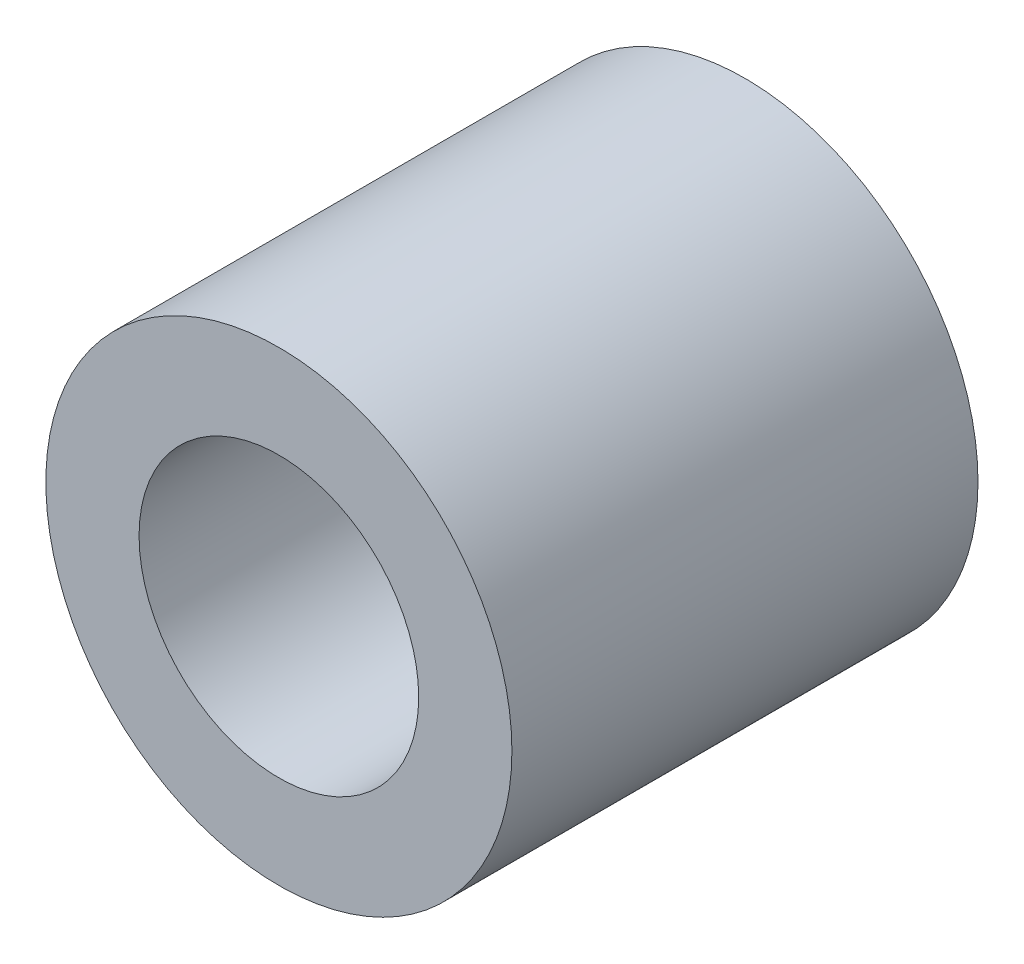
ISO-10303-21;
HEADER;
FILE_DESCRIPTION(('STEP AP214'),'2;1');
FILE_NAME('part.step','',(''),(''),'','','');
FILE_SCHEMA(('AUTOMOTIVE_DESIGN { 1 0 10303 214 1 1 1 1 }'));
ENDSEC;
DATA;
#1=APPLICATION_CONTEXT('core data for automotive mechanical design processes');
#2=APPLICATION_PROTOCOL_DEFINITION('international standard','automotive_design',2000,#1);
#3=PRODUCT_CONTEXT('',#1,'mechanical');
#4=PRODUCT('Part','Part','',(#3));
#5=PRODUCT_RELATED_PRODUCT_CATEGORY('part','',(#4));
#6=PRODUCT_DEFINITION_FORMATION('','',#4);
#7=PRODUCT_DEFINITION_CONTEXT('part definition',#1,'design');
#8=PRODUCT_DEFINITION('design','',#6,#7);
#9=PRODUCT_DEFINITION_SHAPE('','',#8);
#10=(LENGTH_UNIT() NAMED_UNIT(*) SI_UNIT(.MILLI.,.METRE.));
#11=(NAMED_UNIT(*) PLANE_ANGLE_UNIT() SI_UNIT($,.RADIAN.));
#12=(NAMED_UNIT(*) SI_UNIT($,.STERADIAN.) SOLID_ANGLE_UNIT());
#13=UNCERTAINTY_MEASURE_WITH_UNIT(LENGTH_MEASURE(1.E-05),#10,'distance_accuracy_value','');
#14=(GEOMETRIC_REPRESENTATION_CONTEXT(3) GLOBAL_UNCERTAINTY_ASSIGNED_CONTEXT((#13)) GLOBAL_UNIT_ASSIGNED_CONTEXT((#10,
#11,#12)) REPRESENTATION_CONTEXT('',''));
#15=CARTESIAN_POINT('',(0.,0.,0.));
#16=DIRECTION('',(0.,0.,1.));
#17=DIRECTION('',(1.,0.,0.));
#18=AXIS2_PLACEMENT_3D('',#15,#16,#17);
#19=CARTESIAN_POINT('',(0.,0.,5.));
#20=DIRECTION('',(0.,0.,1.));
#21=DIRECTION('',(1.,0.,0.));
#22=AXIS2_PLACEMENT_3D('',#19,#20,#21);
#23=PLANE('',#22);
#24=CARTESIAN_POINT('',(0.,0.,5.));
#25=DIRECTION('',(0.,0.,1.));
#26=DIRECTION('',(1.,0.,0.));
#27=AXIS2_PLACEMENT_3D('',#24,#25,#26);
#28=CIRCLE('',#27,2.5);
#29=CARTESIAN_POINT('',(2.5,0.,5.));
#30=VERTEX_POINT('',#29);
#31=EDGE_CURVE('E10',#30,#30,#28,.T.);
#32=ORIENTED_EDGE('',*,*,#31,.T.);
#33=EDGE_LOOP('',(#32));
#34=FACE_BOUND('',#33,.T.);
#35=CARTESIAN_POINT('',(0.,0.,5.));
#36=DIRECTION('',(0.,0.,1.));
#37=DIRECTION('',(1.,0.,0.));
#38=AXIS2_PLACEMENT_3D('',#35,#36,#37);
#39=CIRCLE('',#38,1.5);
#40=CARTESIAN_POINT('',(1.5,0.,5.));
#41=VERTEX_POINT('',#40);
#42=EDGE_CURVE('E44',#41,#41,#39,.T.);
#43=ORIENTED_EDGE('',*,*,#42,.F.);
#44=EDGE_LOOP('',(#43));
#45=FACE_BOUND('',#44,.T.);
#46=ADVANCED_FACE('F33',(#34,#45),#23,.T.);
#47=CARTESIAN_POINT('',(0.,0.,0.));
#48=DIRECTION('',(0.,0.,1.));
#49=DIRECTION('',(1.,0.,0.));
#50=AXIS2_PLACEMENT_3D('',#47,#48,#49);
#51=PLANE('',#50);
#52=CARTESIAN_POINT('',(0.,0.,0.));
#53=DIRECTION('',(0.,0.,1.));
#54=DIRECTION('',(1.,0.,0.));
#55=AXIS2_PLACEMENT_3D('',#52,#53,#54);
#56=CIRCLE('',#55,2.5);
#57=CARTESIAN_POINT('',(2.5,0.,0.));
#58=VERTEX_POINT('',#57);
#59=EDGE_CURVE('E37',#58,#58,#56,.T.);
#60=ORIENTED_EDGE('',*,*,#59,.F.);
#61=EDGE_LOOP('',(#60));
#62=FACE_BOUND('',#61,.T.);
#63=CARTESIAN_POINT('',(0.,0.,0.));
#64=DIRECTION('',(0.,0.,1.));
#65=DIRECTION('',(1.,0.,0.));
#66=AXIS2_PLACEMENT_3D('',#63,#64,#65);
#67=CIRCLE('',#66,1.5);
#68=CARTESIAN_POINT('',(1.5,0.,0.));
#69=VERTEX_POINT('',#68);
#70=EDGE_CURVE('E46',#69,#69,#67,.T.);
#71=ORIENTED_EDGE('',*,*,#70,.T.);
#72=EDGE_LOOP('',(#71));
#73=FACE_BOUND('',#72,.T.);
#74=ADVANCED_FACE('F56',(#62,#73),#51,.F.);
#75=CARTESIAN_POINT('',(0.,0.,5.));
#76=DIRECTION('',(0.,0.,-1.));
#77=DIRECTION('',(-1.,0.,0.));
#78=AXIS2_PLACEMENT_3D('',#75,#76,#77);
#79=CYLINDRICAL_SURFACE('',#78,2.5);
#80=ORIENTED_EDGE('',*,*,#31,.F.);
#81=EDGE_LOOP('',(#80));
#82=FACE_BOUND('',#81,.T.);
#83=ORIENTED_EDGE('',*,*,#59,.T.);
#84=EDGE_LOOP('',(#83));
#85=FACE_BOUND('',#84,.T.);
#86=ADVANCED_FACE('F35',(#82,#85),#79,.T.);
#87=CARTESIAN_POINT('',(0.,0.,5.));
#88=DIRECTION('',(0.,0.,-1.));
#89=DIRECTION('',(-1.,0.,0.));
#90=AXIS2_PLACEMENT_3D('',#87,#88,#89);
#91=CYLINDRICAL_SURFACE('',#90,1.5);
#92=ORIENTED_EDGE('',*,*,#42,.T.);
#93=EDGE_LOOP('',(#92));
#94=FACE_BOUND('',#93,.T.);
#95=ORIENTED_EDGE('',*,*,#70,.F.);
#96=EDGE_LOOP('',(#95));
#97=FACE_BOUND('',#96,.T.);
#98=ADVANCED_FACE('F52',(#94,#97),#91,.F.);
#99=CLOSED_SHELL('',(#46,#74,#86,#98));
#100=MANIFOLD_SOLID_BREP('B2',#99);
#101=ADVANCED_BREP_SHAPE_REPRESENTATION('',(#18,#100),#14);
#102=SHAPE_DEFINITION_REPRESENTATION(#9,#101);
ENDSEC;
END-ISO-10303-21;
